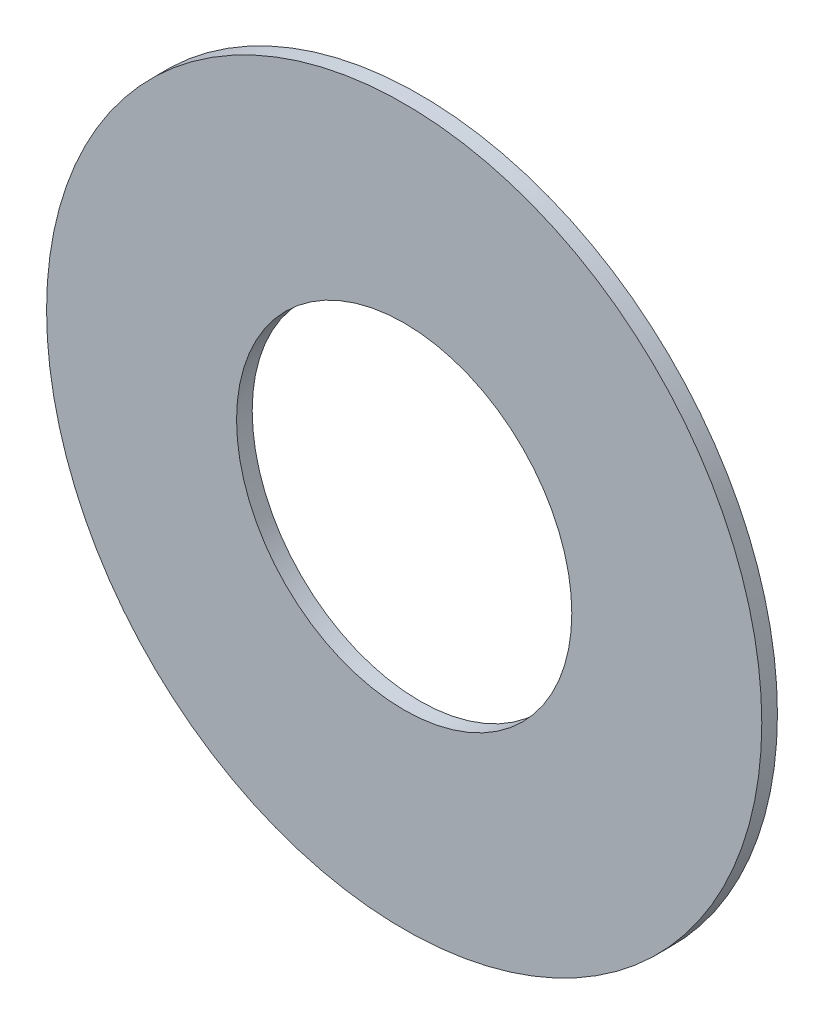
ISO-10303-21;
HEADER;
FILE_DESCRIPTION(('STEP AP214'),'2;1');
FILE_NAME('part.step','',(''),(''),'','','');
FILE_SCHEMA(('AUTOMOTIVE_DESIGN { 1 0 10303 214 1 1 1 1 }'));
ENDSEC;
DATA;
#1=APPLICATION_CONTEXT('core data for automotive mechanical design processes');
#2=APPLICATION_PROTOCOL_DEFINITION('international standard','automotive_design',2000,#1);
#3=PRODUCT_CONTEXT('',#1,'mechanical');
#4=PRODUCT('Part','Part','',(#3));
#5=PRODUCT_RELATED_PRODUCT_CATEGORY('part','',(#4));
#6=PRODUCT_DEFINITION_FORMATION('','',#4);
#7=PRODUCT_DEFINITION_CONTEXT('part definition',#1,'design');
#8=PRODUCT_DEFINITION('design','',#6,#7);
#9=PRODUCT_DEFINITION_SHAPE('','',#8);
#10=(LENGTH_UNIT() NAMED_UNIT(*) SI_UNIT(.MILLI.,.METRE.));
#11=(NAMED_UNIT(*) PLANE_ANGLE_UNIT() SI_UNIT($,.RADIAN.));
#12=(NAMED_UNIT(*) SI_UNIT($,.STERADIAN.) SOLID_ANGLE_UNIT());
#13=UNCERTAINTY_MEASURE_WITH_UNIT(LENGTH_MEASURE(1.E-05),#10,'distance_accuracy_value','');
#14=(GEOMETRIC_REPRESENTATION_CONTEXT(3) GLOBAL_UNCERTAINTY_ASSIGNED_CONTEXT((#13)) GLOBAL_UNIT_ASSIGNED_CONTEXT((#10,
#11,#12)) REPRESENTATION_CONTEXT('',''));
#15=CARTESIAN_POINT('',(0.,0.,0.));
#16=DIRECTION('',(0.,0.,1.));
#17=DIRECTION('',(1.,0.,0.));
#18=AXIS2_PLACEMENT_3D('',#15,#16,#17);
#19=CARTESIAN_POINT('',(155.448,-76.2,-0.045));
#20=DIRECTION('',(0.,0.,-1.));
#21=DIRECTION('',(0.,-1.,0.));
#22=AXIS2_PLACEMENT_3D('',#19,#20,#21);
#23=CYLINDRICAL_SURFACE('',#22,0.375);
#24=CARTESIAN_POINT('',(155.448,-76.2,-0.035));
#25=DIRECTION('',(0.,0.,-1.));
#26=DIRECTION('',(0.,-1.,0.));
#27=AXIS2_PLACEMENT_3D('',#24,#25,#26);
#28=CIRCLE('',#27,0.375);
#29=CARTESIAN_POINT('',(155.448,-76.575,-0.035));
#30=VERTEX_POINT('',#29);
#31=EDGE_CURVE('E25',#30,#30,#28,.T.);
#32=ORIENTED_EDGE('',*,*,#31,.T.);
#33=DIRECTION('',(0.,0.,1.));
#34=VECTOR('',#33,1.);
#35=CARTESIAN_POINT('',(155.448,-76.575,-0.045));
#36=LINE('',#35,#34);
#37=CARTESIAN_POINT('',(155.448,-76.575,0.));
#38=VERTEX_POINT('',#37);
#39=EDGE_CURVE('E11',#30,#38,#36,.T.);
#40=ORIENTED_EDGE('',*,*,#39,.T.);
#41=CARTESIAN_POINT('',(155.448,-76.2,0.));
#42=DIRECTION('',(0.,0.,-1.));
#43=DIRECTION('',(0.,-1.,0.));
#44=AXIS2_PLACEMENT_3D('',#41,#42,#43);
#45=CIRCLE('',#44,0.375);
#46=EDGE_CURVE('E69',#38,#38,#45,.T.);
#47=ORIENTED_EDGE('',*,*,#46,.F.);
#48=ORIENTED_EDGE('',*,*,#39,.F.);
#49=EDGE_LOOP('',(#32,#40,#47,#48));
#50=FACE_BOUND('',#49,.T.);
#51=ADVANCED_FACE('F17',(#50),#23,.F.);
#52=CARTESIAN_POINT('',(155.448,-76.2,-0.035));
#53=DIRECTION('',(0.,0.,1.));
#54=DIRECTION('',(1.,0.,0.));
#55=AXIS2_PLACEMENT_3D('',#52,#53,#54);
#56=PLANE('',#55);
#57=ORIENTED_EDGE('',*,*,#31,.F.);
#58=EDGE_LOOP('',(#57));
#59=FACE_BOUND('',#58,.T.);
#60=CARTESIAN_POINT('',(155.448,-76.2,-0.035));
#61=DIRECTION('',(0.,0.,1.));
#62=DIRECTION('',(1.,0.,0.));
#63=AXIS2_PLACEMENT_3D('',#60,#61,#62);
#64=CIRCLE('',#63,0.8);
#65=CARTESIAN_POINT('',(156.248,-76.2,-0.035));
#66=VERTEX_POINT('',#65);
#67=EDGE_CURVE('E56',#66,#66,#64,.T.);
#68=ORIENTED_EDGE('',*,*,#67,.F.);
#69=EDGE_LOOP('',(#68));
#70=FACE_BOUND('',#69,.T.);
#71=ADVANCED_FACE('F76',(#59,#70),#56,.F.);
#72=CARTESIAN_POINT('',(155.448,-76.2,0.));
#73=DIRECTION('',(0.,0.,1.));
#74=DIRECTION('',(1.,0.,0.));
#75=AXIS2_PLACEMENT_3D('',#72,#73,#74);
#76=PLANE('',#75);
#77=ORIENTED_EDGE('',*,*,#46,.T.);
#78=EDGE_LOOP('',(#77));
#79=FACE_BOUND('',#78,.T.);
#80=CARTESIAN_POINT('',(155.448,-76.2,0.));
#81=DIRECTION('',(0.,0.,1.));
#82=DIRECTION('',(1.,0.,0.));
#83=AXIS2_PLACEMENT_3D('',#80,#81,#82);
#84=CIRCLE('',#83,0.8);
#85=CARTESIAN_POINT('',(156.248,-76.2,0.));
#86=VERTEX_POINT('',#85);
#87=EDGE_CURVE('E54',#86,#86,#84,.T.);
#88=ORIENTED_EDGE('',*,*,#87,.T.);
#89=EDGE_LOOP('',(#88));
#90=FACE_BOUND('',#89,.T.);
#91=ADVANCED_FACE('F60',(#79,#90),#76,.T.);
#92=CARTESIAN_POINT('',(155.448,-76.2,-0.035));
#93=DIRECTION('',(0.,0.,1.));
#94=DIRECTION('',(1.,0.,0.));
#95=AXIS2_PLACEMENT_3D('',#92,#93,#94);
#96=CYLINDRICAL_SURFACE('',#95,0.8);
#97=ORIENTED_EDGE('',*,*,#87,.F.);
#98=DIRECTION('',(0.,0.,1.));
#99=VECTOR('',#98,1.);
#100=CARTESIAN_POINT('',(156.248,-76.2,-0.035));
#101=LINE('',#100,#99);
#102=EDGE_CURVE('E51',#66,#86,#101,.T.);
#103=ORIENTED_EDGE('',*,*,#102,.F.);
#104=ORIENTED_EDGE('',*,*,#67,.T.);
#105=ORIENTED_EDGE('',*,*,#102,.T.);
#106=EDGE_LOOP('',(#97,#103,#104,#105));
#107=FACE_BOUND('',#106,.T.);
#108=ADVANCED_FACE('F53',(#107),#96,.T.);
#109=CLOSED_SHELL('',(#51,#71,#91,#108));
#110=MANIFOLD_SOLID_BREP('B1',#109);
#111=ADVANCED_BREP_SHAPE_REPRESENTATION('',(#18,#110),#14);
#112=SHAPE_DEFINITION_REPRESENTATION(#9,#111);
ENDSEC;
END-ISO-10303-21;
